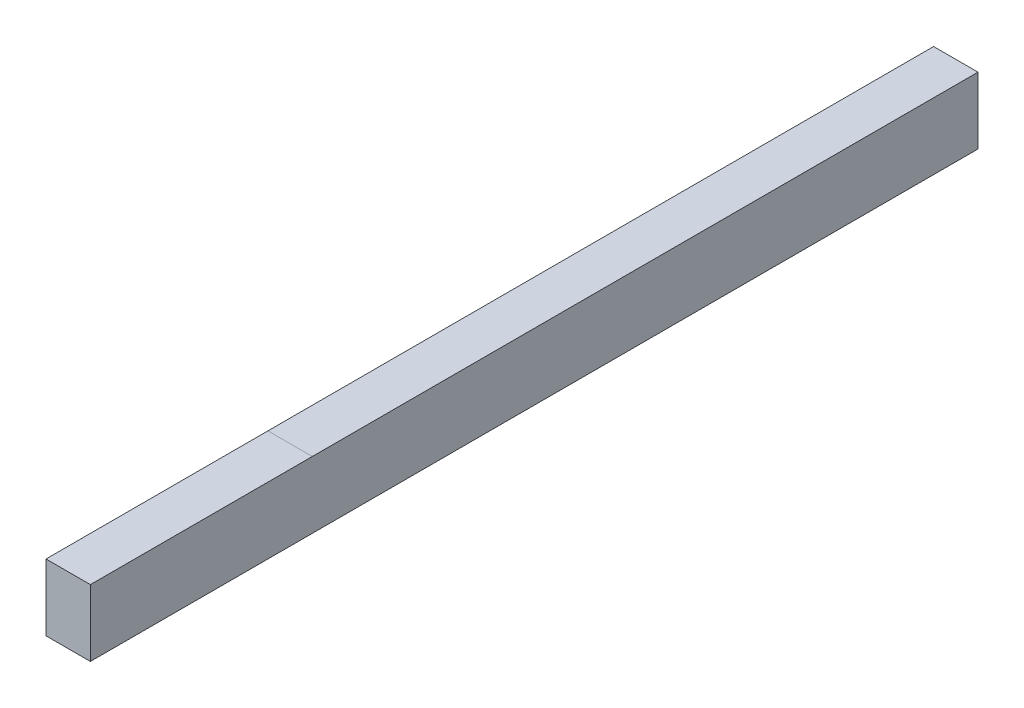
ISO-10303-21;
HEADER;
FILE_DESCRIPTION(('STEP AP214'),'2;1');
FILE_NAME('part.step','',(''),(''),'','','');
FILE_SCHEMA(('AUTOMOTIVE_DESIGN { 1 0 10303 214 1 1 1 1 }'));
ENDSEC;
DATA;
#1=APPLICATION_CONTEXT('core data for automotive mechanical design processes');
#2=APPLICATION_PROTOCOL_DEFINITION('international standard','automotive_design',2000,#1);
#3=PRODUCT_CONTEXT('',#1,'mechanical');
#4=PRODUCT('Part','Part','',(#3));
#5=PRODUCT_RELATED_PRODUCT_CATEGORY('part','',(#4));
#6=PRODUCT_DEFINITION_FORMATION('','',#4);
#7=PRODUCT_DEFINITION_CONTEXT('part definition',#1,'design');
#8=PRODUCT_DEFINITION('design','',#6,#7);
#9=PRODUCT_DEFINITION_SHAPE('','',#8);
#10=(LENGTH_UNIT() NAMED_UNIT(*) SI_UNIT(.MILLI.,.METRE.));
#11=(NAMED_UNIT(*) PLANE_ANGLE_UNIT() SI_UNIT($,.RADIAN.));
#12=(NAMED_UNIT(*) SI_UNIT($,.STERADIAN.) SOLID_ANGLE_UNIT());
#13=UNCERTAINTY_MEASURE_WITH_UNIT(LENGTH_MEASURE(1.E-05),#10,'distance_accuracy_value','');
#14=(GEOMETRIC_REPRESENTATION_CONTEXT(3) GLOBAL_UNCERTAINTY_ASSIGNED_CONTEXT((#13)) GLOBAL_UNIT_ASSIGNED_CONTEXT((#10,
#11,#12)) REPRESENTATION_CONTEXT('',''));
#15=CARTESIAN_POINT('',(0.,0.,0.));
#16=DIRECTION('',(0.,0.,1.));
#17=DIRECTION('',(1.,0.,0.));
#18=AXIS2_PLACEMENT_3D('',#15,#16,#17);
#19=CARTESIAN_POINT('',(0.,15.,200.));
#20=DIRECTION('',(0.,-1.,0.));
#21=DIRECTION('',(0.,0.,-1.));
#22=AXIS2_PLACEMENT_3D('',#19,#20,#21);
#23=PLANE('',#22);
#24=DIRECTION('',(1.,0.,0.));
#25=VECTOR('',#24,1.);
#26=CARTESIAN_POINT('',(0.,15.,150.));
#27=LINE('',#26,#25);
#28=CARTESIAN_POINT('',(0.,15.,150.));
#29=VERTEX_POINT('',#28);
#30=CARTESIAN_POINT('',(10.,15.,150.));
#31=VERTEX_POINT('',#30);
#32=EDGE_CURVE('E12',#29,#31,#27,.T.);
#33=ORIENTED_EDGE('',*,*,#32,.F.);
#34=DIRECTION('',(0.,0.,-1.));
#35=VECTOR('',#34,1.);
#36=CARTESIAN_POINT('',(0.,15.,200.));
#37=LINE('',#36,#35);
#38=CARTESIAN_POINT('',(0.,15.,200.));
#39=VERTEX_POINT('',#38);
#40=EDGE_CURVE('E143',#39,#29,#37,.T.);
#41=ORIENTED_EDGE('',*,*,#40,.F.);
#42=DIRECTION('',(-1.,0.,0.));
#43=VECTOR('',#42,1.);
#44=CARTESIAN_POINT('',(0.,15.,200.));
#45=LINE('',#44,#43);
#46=CARTESIAN_POINT('',(10.,15.,200.));
#47=VERTEX_POINT('',#46);
#48=EDGE_CURVE('E118',#47,#39,#45,.T.);
#49=ORIENTED_EDGE('',*,*,#48,.F.);
#50=DIRECTION('',(0.,0.,-1.));
#51=VECTOR('',#50,1.);
#52=CARTESIAN_POINT('',(10.,15.,200.));
#53=LINE('',#52,#51);
#54=EDGE_CURVE('E127',#47,#31,#53,.T.);
#55=ORIENTED_EDGE('',*,*,#54,.T.);
#56=EDGE_LOOP('',(#33,#41,#49,#55));
#57=FACE_BOUND('',#56,.T.);
#58=ADVANCED_FACE('F54',(#57),#23,.F.);
#59=CARTESIAN_POINT('',(0.,0.,200.));
#60=DIRECTION('',(1.,0.,0.));
#61=DIRECTION('',(0.,0.,-1.));
#62=AXIS2_PLACEMENT_3D('',#59,#60,#61);
#63=PLANE('',#62);
#64=DIRECTION('',(0.,-1.,0.));
#65=VECTOR('',#64,1.);
#66=CARTESIAN_POINT('',(0.,0.,0.));
#67=LINE('',#66,#65);
#68=CARTESIAN_POINT('',(0.,15.,0.));
#69=VERTEX_POINT('',#68);
#70=CARTESIAN_POINT('',(0.,0.,0.));
#71=VERTEX_POINT('',#70);
#72=EDGE_CURVE('E124',#69,#71,#67,.T.);
#73=ORIENTED_EDGE('',*,*,#72,.T.);
#74=DIRECTION('',(0.,0.,-1.));
#75=VECTOR('',#74,1.);
#76=CARTESIAN_POINT('',(0.,0.,200.));
#77=LINE('',#76,#75);
#78=CARTESIAN_POINT('',(0.,0.,200.));
#79=VERTEX_POINT('',#78);
#80=EDGE_CURVE('E63',#79,#71,#77,.T.);
#81=ORIENTED_EDGE('',*,*,#80,.F.);
#82=DIRECTION('',(0.,-1.,0.));
#83=VECTOR('',#82,1.);
#84=CARTESIAN_POINT('',(0.,0.,200.));
#85=LINE('',#84,#83);
#86=EDGE_CURVE('E113',#39,#79,#85,.T.);
#87=ORIENTED_EDGE('',*,*,#86,.F.);
#88=ORIENTED_EDGE('',*,*,#40,.T.);
#89=EDGE_CURVE('E145',#29,#69,#37,.T.);
#90=ORIENTED_EDGE('',*,*,#89,.T.);
#91=EDGE_LOOP('',(#73,#81,#87,#88,#90));
#92=FACE_BOUND('',#91,.T.);
#93=ADVANCED_FACE('F56',(#92),#63,.F.);
#94=CARTESIAN_POINT('',(0.,0.,200.));
#95=DIRECTION('',(0.,1.,0.));
#96=DIRECTION('',(0.,0.,1.));
#97=AXIS2_PLACEMENT_3D('',#94,#95,#96);
#98=PLANE('',#97);
#99=DIRECTION('',(1.,0.,0.));
#100=VECTOR('',#99,1.);
#101=CARTESIAN_POINT('',(0.,0.,0.));
#102=LINE('',#101,#100);
#103=CARTESIAN_POINT('',(10.,0.,0.));
#104=VERTEX_POINT('',#103);
#105=EDGE_CURVE('E133',#71,#104,#102,.T.);
#106=ORIENTED_EDGE('',*,*,#105,.T.);
#107=DIRECTION('',(0.,0.,-1.));
#108=VECTOR('',#107,1.);
#109=CARTESIAN_POINT('',(10.,0.,200.));
#110=LINE('',#109,#108);
#111=CARTESIAN_POINT('',(10.,0.,200.));
#112=VERTEX_POINT('',#111);
#113=EDGE_CURVE('E109',#112,#104,#110,.T.);
#114=ORIENTED_EDGE('',*,*,#113,.F.);
#115=DIRECTION('',(1.,0.,0.));
#116=VECTOR('',#115,1.);
#117=CARTESIAN_POINT('',(0.,0.,200.));
#118=LINE('',#117,#116);
#119=EDGE_CURVE('E103',#79,#112,#118,.T.);
#120=ORIENTED_EDGE('',*,*,#119,.F.);
#121=ORIENTED_EDGE('',*,*,#80,.T.);
#122=EDGE_LOOP('',(#106,#114,#120,#121));
#123=FACE_BOUND('',#122,.T.);
#124=ADVANCED_FACE('F105',(#123),#98,.F.);
#125=CARTESIAN_POINT('',(10.,0.,200.));
#126=DIRECTION('',(-1.,0.,0.));
#127=DIRECTION('',(0.,0.,1.));
#128=AXIS2_PLACEMENT_3D('',#125,#126,#127);
#129=PLANE('',#128);
#130=DIRECTION('',(0.,1.,0.));
#131=VECTOR('',#130,1.);
#132=CARTESIAN_POINT('',(10.,0.,0.));
#133=LINE('',#132,#131);
#134=CARTESIAN_POINT('',(10.,15.,0.));
#135=VERTEX_POINT('',#134);
#136=EDGE_CURVE('E136',#104,#135,#133,.T.);
#137=ORIENTED_EDGE('',*,*,#136,.T.);
#138=EDGE_CURVE('E144',#31,#135,#53,.T.);
#139=ORIENTED_EDGE('',*,*,#138,.F.);
#140=ORIENTED_EDGE('',*,*,#54,.F.);
#141=DIRECTION('',(0.,1.,0.));
#142=VECTOR('',#141,1.);
#143=CARTESIAN_POINT('',(10.,0.,200.));
#144=LINE('',#143,#142);
#145=EDGE_CURVE('E112',#112,#47,#144,.T.);
#146=ORIENTED_EDGE('',*,*,#145,.F.);
#147=ORIENTED_EDGE('',*,*,#113,.T.);
#148=EDGE_LOOP('',(#137,#139,#140,#146,#147));
#149=FACE_BOUND('',#148,.T.);
#150=ADVANCED_FACE('F151',(#149),#129,.F.);
#151=ORIENTED_EDGE('',*,*,#89,.F.);
#152=ORIENTED_EDGE('',*,*,#32,.T.);
#153=ORIENTED_EDGE('',*,*,#138,.T.);
#154=DIRECTION('',(-1.,0.,0.));
#155=VECTOR('',#154,1.);
#156=CARTESIAN_POINT('',(0.,15.,0.));
#157=LINE('',#156,#155);
#158=EDGE_CURVE('E121',#135,#69,#157,.T.);
#159=ORIENTED_EDGE('',*,*,#158,.T.);
#160=EDGE_LOOP('',(#151,#152,#153,#159));
#161=FACE_BOUND('',#160,.T.);
#162=ADVANCED_FACE('F147',(#161),#23,.F.);
#163=CARTESIAN_POINT('',(0.,0.,200.));
#164=DIRECTION('',(0.,0.,-1.));
#165=DIRECTION('',(-1.,0.,0.));
#166=AXIS2_PLACEMENT_3D('',#163,#164,#165);
#167=PLANE('',#166);
#168=ORIENTED_EDGE('',*,*,#86,.T.);
#169=ORIENTED_EDGE('',*,*,#119,.T.);
#170=ORIENTED_EDGE('',*,*,#145,.T.);
#171=ORIENTED_EDGE('',*,*,#48,.T.);
#172=EDGE_LOOP('',(#168,#169,#170,#171));
#173=FACE_BOUND('',#172,.T.);
#174=ADVANCED_FACE('F116',(#173),#167,.F.);
#175=CARTESIAN_POINT('',(0.,0.,0.));
#176=DIRECTION('',(0.,0.,-1.));
#177=DIRECTION('',(-1.,0.,0.));
#178=AXIS2_PLACEMENT_3D('',#175,#176,#177);
#179=PLANE('',#178);
#180=ORIENTED_EDGE('',*,*,#72,.F.);
#181=ORIENTED_EDGE('',*,*,#158,.F.);
#182=ORIENTED_EDGE('',*,*,#136,.F.);
#183=ORIENTED_EDGE('',*,*,#105,.F.);
#184=EDGE_LOOP('',(#180,#181,#182,#183));
#185=FACE_BOUND('',#184,.T.);
#186=ADVANCED_FACE('F153',(#185),#179,.T.);
#187=CLOSED_SHELL('',(#58,#93,#124,#150,#162,#174,#186));
#188=MANIFOLD_SOLID_BREP('B2',#187);
#189=ADVANCED_BREP_SHAPE_REPRESENTATION('',(#18,#188),#14);
#190=SHAPE_DEFINITION_REPRESENTATION(#9,#189);
ENDSEC;
END-ISO-10303-21;
